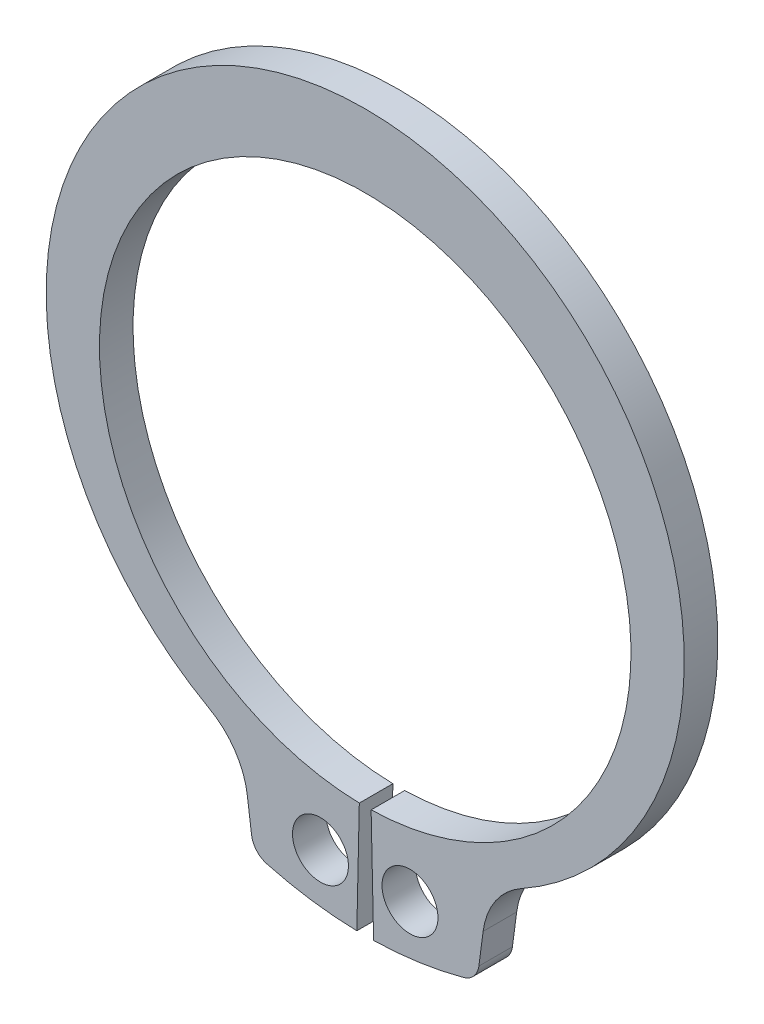
ISO-10303-21;
HEADER;
FILE_DESCRIPTION(('STEP AP214'),'2;1');
FILE_NAME('part.step','',(''),(''),'','','');
FILE_SCHEMA(('AUTOMOTIVE_DESIGN { 1 0 10303 214 1 1 1 1 }'));
ENDSEC;
DATA;
#1=APPLICATION_CONTEXT('core data for automotive mechanical design processes');
#2=APPLICATION_PROTOCOL_DEFINITION('international standard','automotive_design',2000,#1);
#3=PRODUCT_CONTEXT('',#1,'mechanical');
#4=PRODUCT('Part','Part','',(#3));
#5=PRODUCT_RELATED_PRODUCT_CATEGORY('part','',(#4));
#6=PRODUCT_DEFINITION_FORMATION('','',#4);
#7=PRODUCT_DEFINITION_CONTEXT('part definition',#1,'design');
#8=PRODUCT_DEFINITION('design','',#6,#7);
#9=PRODUCT_DEFINITION_SHAPE('','',#8);
#10=(LENGTH_UNIT() NAMED_UNIT(*) SI_UNIT(.MILLI.,.METRE.));
#11=(NAMED_UNIT(*) PLANE_ANGLE_UNIT() SI_UNIT($,.RADIAN.));
#12=(NAMED_UNIT(*) SI_UNIT($,.STERADIAN.) SOLID_ANGLE_UNIT());
#13=UNCERTAINTY_MEASURE_WITH_UNIT(LENGTH_MEASURE(1.E-05),#10,'distance_accuracy_value','');
#14=(GEOMETRIC_REPRESENTATION_CONTEXT(3) GLOBAL_UNCERTAINTY_ASSIGNED_CONTEXT((#13)) GLOBAL_UNIT_ASSIGNED_CONTEXT((#10,
#11,#12)) REPRESENTATION_CONTEXT('',''));
#15=CARTESIAN_POINT('',(0.,0.,0.));
#16=DIRECTION('',(0.,0.,1.));
#17=DIRECTION('',(1.,0.,0.));
#18=AXIS2_PLACEMENT_3D('',#15,#16,#17);
#19=CARTESIAN_POINT('',(0.,0.,-1.2));
#20=DIRECTION('',(0.,0.,1.));
#21=DIRECTION('',(1.,0.,0.));
#22=AXIS2_PLACEMENT_3D('',#19,#20,#21);
#23=CYLINDRICAL_SURFACE('',#22,9.5);
#24=CARTESIAN_POINT('',(0.,0.,0.));
#25=DIRECTION('',(0.,0.,-1.));
#26=DIRECTION('',(1.,0.,0.));
#27=AXIS2_PLACEMENT_3D('',#24,#25,#26);
#28=CIRCLE('',#27,9.5);
#29=CARTESIAN_POINT('',(-0.211111111111111,-9.49765403132613,0.));
#30=VERTEX_POINT('',#29);
#31=CARTESIAN_POINT('',(0.211111111111111,-9.49765403132613,0.));
#32=VERTEX_POINT('',#31);
#33=EDGE_CURVE('E154',#30,#32,#28,.T.);
#34=ORIENTED_EDGE('',*,*,#33,.F.);
#35=DIRECTION('',(0.,0.,1.));
#36=VECTOR('',#35,1.);
#37=CARTESIAN_POINT('',(-0.211111111111111,-9.49765403132613,-1.2));
#38=LINE('',#37,#36);
#39=CARTESIAN_POINT('',(-0.211111111111111,-9.49765403132613,-1.2));
#40=VERTEX_POINT('',#39);
#41=EDGE_CURVE('E11',#40,#30,#38,.T.);
#42=ORIENTED_EDGE('',*,*,#41,.F.);
#43=CARTESIAN_POINT('',(0.,0.,-1.2));
#44=DIRECTION('',(0.,0.,-1.));
#45=DIRECTION('',(1.,0.,0.));
#46=AXIS2_PLACEMENT_3D('',#43,#44,#45);
#47=CIRCLE('',#46,9.5);
#48=CARTESIAN_POINT('',(0.211111111111111,-9.49765403132613,-1.2));
#49=VERTEX_POINT('',#48);
#50=EDGE_CURVE('E187',#40,#49,#47,.T.);
#51=ORIENTED_EDGE('',*,*,#50,.T.);
#52=DIRECTION('',(0.,0.,1.));
#53=VECTOR('',#52,1.);
#54=CARTESIAN_POINT('',(0.211111111111111,-9.49765403132613,-1.2));
#55=LINE('',#54,#53);
#56=EDGE_CURVE('E36',#49,#32,#55,.T.);
#57=ORIENTED_EDGE('',*,*,#56,.T.);
#58=EDGE_LOOP('',(#34,#42,#51,#57));
#59=FACE_BOUND('',#58,.T.);
#60=ADVANCED_FACE('F33',(#59),#23,.F.);
#61=CARTESIAN_POINT('',(-0.211111111111111,-9.49765403132613,-1.2));
#62=DIRECTION('',(0.999753055929066,-0.0222222222222222,0.));
#63=DIRECTION('',(0.0222222222222222,0.999753055929066,0.));
#64=AXIS2_PLACEMENT_3D('',#61,#62,#63);
#65=PLANE('',#64);
#66=DIRECTION('',(0.0222222222222222,0.999753055929066,0.));
#67=VECTOR('',#66,1.);
#68=CARTESIAN_POINT('',(-0.211111111111111,-9.49765403132613,0.));
#69=LINE('',#68,#67);
#70=CARTESIAN_POINT('',(-0.3,-13.4966662550424,0.));
#71=VERTEX_POINT('',#70);
#72=EDGE_CURVE('E185',#71,#30,#69,.T.);
#73=ORIENTED_EDGE('',*,*,#72,.F.);
#74=DIRECTION('',(0.,0.,1.));
#75=VECTOR('',#74,1.);
#76=CARTESIAN_POINT('',(-0.3,-13.4966662550424,-1.2));
#77=LINE('',#76,#75);
#78=CARTESIAN_POINT('',(-0.3,-13.4966662550424,-1.2));
#79=VERTEX_POINT('',#78);
#80=EDGE_CURVE('E42',#79,#71,#77,.T.);
#81=ORIENTED_EDGE('',*,*,#80,.F.);
#82=DIRECTION('',(0.0222222222222222,0.999753055929066,0.));
#83=VECTOR('',#82,1.);
#84=CARTESIAN_POINT('',(-0.211111111111111,-9.49765403132613,-1.2));
#85=LINE('',#84,#83);
#86=EDGE_CURVE('E144',#79,#40,#85,.T.);
#87=ORIENTED_EDGE('',*,*,#86,.T.);
#88=ORIENTED_EDGE('',*,*,#41,.T.);
#89=EDGE_LOOP('',(#73,#81,#87,#88));
#90=FACE_BOUND('',#89,.T.);
#91=ADVANCED_FACE('F207',(#90),#65,.T.);
#92=CARTESIAN_POINT('',(0.,0.,-1.2));
#93=DIRECTION('',(0.,0.,1.));
#94=DIRECTION('',(1.,0.,0.));
#95=AXIS2_PLACEMENT_3D('',#92,#93,#94);
#96=CYLINDRICAL_SURFACE('',#95,13.5);
#97=CARTESIAN_POINT('',(0.,0.,0.));
#98=DIRECTION('',(0.,0.,1.));
#99=DIRECTION('',(1.,0.,0.));
#100=AXIS2_PLACEMENT_3D('',#97,#98,#99);
#101=CIRCLE('',#100,13.5);
#102=CARTESIAN_POINT('',(-3.51438519045818,-13.034534772407,0.));
#103=VERTEX_POINT('',#102);
#104=EDGE_CURVE('E131',#103,#71,#101,.T.);
#105=ORIENTED_EDGE('',*,*,#104,.F.);
#106=DIRECTION('',(0.,0.,1.));
#107=VECTOR('',#106,1.);
#108=CARTESIAN_POINT('',(-3.51438519045818,-13.034534772407,-1.2));
#109=LINE('',#108,#107);
#110=CARTESIAN_POINT('',(-3.51438519045818,-13.034534772407,-1.2));
#111=VERTEX_POINT('',#110);
#112=EDGE_CURVE('E126',#111,#103,#109,.T.);
#113=ORIENTED_EDGE('',*,*,#112,.F.);
#114=CARTESIAN_POINT('',(0.,0.,-1.2));
#115=DIRECTION('',(0.,0.,1.));
#116=DIRECTION('',(1.,0.,0.));
#117=AXIS2_PLACEMENT_3D('',#114,#115,#116);
#118=CIRCLE('',#117,13.5);
#119=EDGE_CURVE('E129',#111,#79,#118,.T.);
#120=ORIENTED_EDGE('',*,*,#119,.T.);
#121=ORIENTED_EDGE('',*,*,#80,.T.);
#122=EDGE_LOOP('',(#105,#113,#120,#121));
#123=FACE_BOUND('',#122,.T.);
#124=ADVANCED_FACE('F128',(#123),#96,.T.);
#125=CARTESIAN_POINT('',(-3.31914156876606,-12.3103939517178,-1.2));
#126=DIRECTION('',(0.,0.,1.));
#127=DIRECTION('',(1.,0.,0.));
#128=AXIS2_PLACEMENT_3D('',#125,#126,#127);
#129=CYLINDRICAL_SURFACE('',#128,0.750000000000001);
#130=CARTESIAN_POINT('',(-3.31914156876606,-12.3103939517178,0.));
#131=DIRECTION('',(0.,0.,1.));
#132=DIRECTION('',(1.,0.,0.));
#133=AXIS2_PLACEMENT_3D('',#130,#131,#132);
#134=CIRCLE('',#133,0.750000000000001);
#135=CARTESIAN_POINT('',(-4.06272521479641,-12.4082885958828,0.));
#136=VERTEX_POINT('',#135);
#137=EDGE_CURVE('E182',#136,#103,#134,.T.);
#138=ORIENTED_EDGE('',*,*,#137,.F.);
#139=DIRECTION('',(0.,0.,1.));
#140=VECTOR('',#139,1.);
#141=CARTESIAN_POINT('',(-4.06272521479641,-12.4082885958828,-1.2));
#142=LINE('',#141,#140);
#143=CARTESIAN_POINT('',(-4.06272521479641,-12.4082885958828,-1.2));
#144=VERTEX_POINT('',#143);
#145=EDGE_CURVE('E136',#144,#136,#142,.T.);
#146=ORIENTED_EDGE('',*,*,#145,.F.);
#147=CARTESIAN_POINT('',(-3.31914156876606,-12.3103939517178,-1.2));
#148=DIRECTION('',(0.,0.,1.));
#149=DIRECTION('',(1.,0.,0.));
#150=AXIS2_PLACEMENT_3D('',#147,#148,#149);
#151=CIRCLE('',#150,0.750000000000001);
#152=EDGE_CURVE('E142',#144,#111,#151,.T.);
#153=ORIENTED_EDGE('',*,*,#152,.T.);
#154=ORIENTED_EDGE('',*,*,#112,.T.);
#155=EDGE_LOOP('',(#138,#146,#153,#154));
#156=FACE_BOUND('',#155,.T.);
#157=ADVANCED_FACE('F146',(#156),#129,.T.);
#158=CARTESIAN_POINT('',(-4.21429248139649,-11.2570209072507,-1.2));
#159=DIRECTION('',(-0.99144486137381,-0.130526192220051,0.));
#160=DIRECTION('',(0.130526192220051,-0.991444861373811,0.));
#161=AXIS2_PLACEMENT_3D('',#158,#159,#160);
#162=PLANE('',#161);
#163=DIRECTION('',(0.130526192220051,-0.99144486137381,0.));
#164=VECTOR('',#163,1.);
#165=CARTESIAN_POINT('',(-4.21429248139649,-11.2570209072507,0.));
#166=LINE('',#165,#164);
#167=CARTESIAN_POINT('',(-4.21429248139649,-11.2570209072507,0.));
#168=VERTEX_POINT('',#167);
#169=EDGE_CURVE('E179',#168,#136,#166,.T.);
#170=ORIENTED_EDGE('',*,*,#169,.F.);
#171=DIRECTION('',(0.,0.,1.));
#172=VECTOR('',#171,1.);
#173=CARTESIAN_POINT('',(-4.21429248139649,-11.2570209072507,-1.2));
#174=LINE('',#173,#172);
#175=CARTESIAN_POINT('',(-4.21429248139649,-11.2570209072507,-1.2));
#176=VERTEX_POINT('',#175);
#177=EDGE_CURVE('E191',#176,#168,#174,.T.);
#178=ORIENTED_EDGE('',*,*,#177,.F.);
#179=DIRECTION('',(0.130526192220051,-0.99144486137381,0.));
#180=VECTOR('',#179,1.);
#181=CARTESIAN_POINT('',(-4.21429248139649,-11.2570209072507,-1.2));
#182=LINE('',#181,#180);
#183=EDGE_CURVE('E147',#176,#144,#182,.T.);
#184=ORIENTED_EDGE('',*,*,#183,.T.);
#185=ORIENTED_EDGE('',*,*,#145,.T.);
#186=EDGE_LOOP('',(#170,#178,#184,#185));
#187=FACE_BOUND('',#186,.T.);
#188=ADVANCED_FACE('F220',(#187),#162,.T.);
#189=CARTESIAN_POINT('',(-6.89014336040812,-11.609303358644,-1.2));
#190=DIRECTION('',(0.,0.,1.));
#191=DIRECTION('',(1.,0.,0.));
#192=AXIS2_PLACEMENT_3D('',#189,#190,#191);
#193=CYLINDRICAL_SURFACE('',#192,2.69894069076499);
#194=CARTESIAN_POINT('',(-6.89014336040812,-11.609303358644,0.));
#195=DIRECTION('',(0.,0.,-1.));
#196=DIRECTION('',(1.,0.,0.));
#197=AXIS2_PLACEMENT_3D('',#194,#195,#196);
#198=CIRCLE('',#197,2.69894069076499);
#199=CARTESIAN_POINT('',(-5.57154974289285,-9.25439535107454,0.));
#200=VERTEX_POINT('',#199);
#201=EDGE_CURVE('E176',#200,#168,#198,.T.);
#202=ORIENTED_EDGE('',*,*,#201,.F.);
#203=DIRECTION('',(0.,0.,1.));
#204=VECTOR('',#203,1.);
#205=CARTESIAN_POINT('',(-5.57154974289285,-9.25439535107454,-1.2));
#206=LINE('',#205,#204);
#207=CARTESIAN_POINT('',(-5.57154974289285,-9.25439535107454,-1.2));
#208=VERTEX_POINT('',#207);
#209=EDGE_CURVE('E193',#208,#200,#206,.T.);
#210=ORIENTED_EDGE('',*,*,#209,.F.);
#211=CARTESIAN_POINT('',(-6.89014336040812,-11.609303358644,-1.2));
#212=DIRECTION('',(0.,0.,-1.));
#213=DIRECTION('',(1.,0.,0.));
#214=AXIS2_PLACEMENT_3D('',#211,#212,#213);
#215=CIRCLE('',#214,2.69894069076499);
#216=EDGE_CURVE('E149',#208,#176,#215,.T.);
#217=ORIENTED_EDGE('',*,*,#216,.T.);
#218=ORIENTED_EDGE('',*,*,#177,.T.);
#219=EDGE_LOOP('',(#202,#210,#217,#218));
#220=FACE_BOUND('',#219,.T.);
#221=ADVANCED_FACE('F223',(#220),#193,.F.);
#222=CARTESIAN_POINT('',(0.,0.695969135623053,-1.2));
#223=DIRECTION('',(0.,0.,1.));
#224=DIRECTION('',(1.,0.,0.));
#225=AXIS2_PLACEMENT_3D('',#222,#223,#224);
#226=CYLINDRICAL_SURFACE('',#225,11.4040308643769);
#227=CARTESIAN_POINT('',(0.,0.695969135623053,0.));
#228=DIRECTION('',(0.,0.,1.));
#229=DIRECTION('',(1.,0.,0.));
#230=AXIS2_PLACEMENT_3D('',#227,#228,#229);
#231=CIRCLE('',#230,11.4040308643769);
#232=CARTESIAN_POINT('',(5.57154974289284,-9.25439535107454,0.));
#233=VERTEX_POINT('',#232);
#234=EDGE_CURVE('E173',#233,#200,#231,.T.);
#235=ORIENTED_EDGE('',*,*,#234,.F.);
#236=DIRECTION('',(0.,0.,1.));
#237=VECTOR('',#236,1.);
#238=CARTESIAN_POINT('',(5.57154974289284,-9.25439535107454,-1.2));
#239=LINE('',#238,#237);
#240=CARTESIAN_POINT('',(5.57154974289284,-9.25439535107454,-1.2));
#241=VERTEX_POINT('',#240);
#242=EDGE_CURVE('E195',#241,#233,#239,.T.);
#243=ORIENTED_EDGE('',*,*,#242,.F.);
#244=CARTESIAN_POINT('',(0.,0.695969135623053,-1.2));
#245=DIRECTION('',(0.,0.,1.));
#246=DIRECTION('',(1.,0.,0.));
#247=AXIS2_PLACEMENT_3D('',#244,#245,#246);
#248=CIRCLE('',#247,11.4040308643769);
#249=EDGE_CURVE('E297',#241,#208,#248,.T.);
#250=ORIENTED_EDGE('',*,*,#249,.T.);
#251=ORIENTED_EDGE('',*,*,#209,.T.);
#252=EDGE_LOOP('',(#235,#243,#250,#251));
#253=FACE_BOUND('',#252,.T.);
#254=ADVANCED_FACE('F227',(#253),#226,.T.);
#255=CARTESIAN_POINT('',(6.89014336040812,-11.609303358644,-1.2));
#256=DIRECTION('',(0.,0.,1.));
#257=DIRECTION('',(1.,0.,0.));
#258=AXIS2_PLACEMENT_3D('',#255,#256,#257);
#259=CYLINDRICAL_SURFACE('',#258,2.69894069076499);
#260=CARTESIAN_POINT('',(6.89014336040812,-11.609303358644,0.));
#261=DIRECTION('',(0.,0.,-1.));
#262=DIRECTION('',(1.,0.,0.));
#263=AXIS2_PLACEMENT_3D('',#260,#261,#262);
#264=CIRCLE('',#263,2.69894069076499);
#265=CARTESIAN_POINT('',(4.21429248139649,-11.2570209072507,0.));
#266=VERTEX_POINT('',#265);
#267=EDGE_CURVE('E170',#266,#233,#264,.T.);
#268=ORIENTED_EDGE('',*,*,#267,.F.);
#269=DIRECTION('',(0.,0.,1.));
#270=VECTOR('',#269,1.);
#271=CARTESIAN_POINT('',(4.21429248139649,-11.2570209072507,-1.2));
#272=LINE('',#271,#270);
#273=CARTESIAN_POINT('',(4.21429248139649,-11.2570209072507,-1.2));
#274=VERTEX_POINT('',#273);
#275=EDGE_CURVE('E197',#274,#266,#272,.T.);
#276=ORIENTED_EDGE('',*,*,#275,.F.);
#277=CARTESIAN_POINT('',(6.89014336040812,-11.609303358644,-1.2));
#278=DIRECTION('',(0.,0.,-1.));
#279=DIRECTION('',(1.,0.,0.));
#280=AXIS2_PLACEMENT_3D('',#277,#278,#279);
#281=CIRCLE('',#280,2.69894069076499);
#282=EDGE_CURVE('E294',#274,#241,#281,.T.);
#283=ORIENTED_EDGE('',*,*,#282,.T.);
#284=ORIENTED_EDGE('',*,*,#242,.T.);
#285=EDGE_LOOP('',(#268,#276,#283,#284));
#286=FACE_BOUND('',#285,.T.);
#287=ADVANCED_FACE('F231',(#286),#259,.F.);
#288=CARTESIAN_POINT('',(4.21429248139649,-11.2570209072507,-1.2));
#289=DIRECTION('',(0.99144486137381,-0.130526192220051,0.));
#290=DIRECTION('',(0.130526192220051,0.991444861373811,0.));
#291=AXIS2_PLACEMENT_3D('',#288,#289,#290);
#292=PLANE('',#291);
#293=DIRECTION('',(0.130526192220051,0.99144486137381,0.));
#294=VECTOR('',#293,1.);
#295=CARTESIAN_POINT('',(4.21429248139649,-11.2570209072507,0.));
#296=LINE('',#295,#294);
#297=CARTESIAN_POINT('',(4.06272521479641,-12.4082885958828,0.));
#298=VERTEX_POINT('',#297);
#299=EDGE_CURVE('E167',#298,#266,#296,.T.);
#300=ORIENTED_EDGE('',*,*,#299,.F.);
#301=DIRECTION('',(0.,0.,1.));
#302=VECTOR('',#301,1.);
#303=CARTESIAN_POINT('',(4.06272521479641,-12.4082885958828,-1.2));
#304=LINE('',#303,#302);
#305=CARTESIAN_POINT('',(4.06272521479641,-12.4082885958828,-1.2));
#306=VERTEX_POINT('',#305);
#307=EDGE_CURVE('E199',#306,#298,#304,.T.);
#308=ORIENTED_EDGE('',*,*,#307,.F.);
#309=DIRECTION('',(0.130526192220051,0.99144486137381,0.));
#310=VECTOR('',#309,1.);
#311=CARTESIAN_POINT('',(4.21429248139649,-11.2570209072507,-1.2));
#312=LINE('',#311,#310);
#313=EDGE_CURVE('E291',#306,#274,#312,.T.);
#314=ORIENTED_EDGE('',*,*,#313,.T.);
#315=ORIENTED_EDGE('',*,*,#275,.T.);
#316=EDGE_LOOP('',(#300,#308,#314,#315));
#317=FACE_BOUND('',#316,.T.);
#318=ADVANCED_FACE('F235',(#317),#292,.T.);
#319=CARTESIAN_POINT('',(3.31914156876606,-12.3103939517178,-1.2));
#320=DIRECTION('',(0.,0.,1.));
#321=DIRECTION('',(1.,0.,0.));
#322=AXIS2_PLACEMENT_3D('',#319,#320,#321);
#323=CYLINDRICAL_SURFACE('',#322,0.750000000000001);
#324=CARTESIAN_POINT('',(3.31914156876606,-12.3103939517178,0.));
#325=DIRECTION('',(0.,0.,1.));
#326=DIRECTION('',(-1.,0.,0.));
#327=AXIS2_PLACEMENT_3D('',#324,#325,#326);
#328=CIRCLE('',#327,0.750000000000001);
#329=CARTESIAN_POINT('',(3.51438519045818,-13.034534772407,0.));
#330=VERTEX_POINT('',#329);
#331=EDGE_CURVE('E164',#330,#298,#328,.T.);
#332=ORIENTED_EDGE('',*,*,#331,.F.);
#333=DIRECTION('',(0.,0.,1.));
#334=VECTOR('',#333,1.);
#335=CARTESIAN_POINT('',(3.51438519045818,-13.034534772407,-1.2));
#336=LINE('',#335,#334);
#337=CARTESIAN_POINT('',(3.51438519045818,-13.034534772407,-1.2));
#338=VERTEX_POINT('',#337);
#339=EDGE_CURVE('E201',#338,#330,#336,.T.);
#340=ORIENTED_EDGE('',*,*,#339,.F.);
#341=CARTESIAN_POINT('',(3.31914156876606,-12.3103939517178,-1.2));
#342=DIRECTION('',(0.,0.,1.));
#343=DIRECTION('',(-1.,0.,0.));
#344=AXIS2_PLACEMENT_3D('',#341,#342,#343);
#345=CIRCLE('',#344,0.750000000000001);
#346=EDGE_CURVE('E288',#338,#306,#345,.T.);
#347=ORIENTED_EDGE('',*,*,#346,.T.);
#348=ORIENTED_EDGE('',*,*,#307,.T.);
#349=EDGE_LOOP('',(#332,#340,#347,#348));
#350=FACE_BOUND('',#349,.T.);
#351=ADVANCED_FACE('F239',(#350),#323,.T.);
#352=CARTESIAN_POINT('',(0.,0.,-1.2));
#353=DIRECTION('',(0.,0.,1.));
#354=DIRECTION('',(1.,0.,0.));
#355=AXIS2_PLACEMENT_3D('',#352,#353,#354);
#356=CYLINDRICAL_SURFACE('',#355,13.5);
#357=CARTESIAN_POINT('',(0.,0.,0.));
#358=DIRECTION('',(0.,0.,1.));
#359=DIRECTION('',(1.,0.,0.));
#360=AXIS2_PLACEMENT_3D('',#357,#358,#359);
#361=CIRCLE('',#360,13.5);
#362=CARTESIAN_POINT('',(0.29999999999999,-13.4966662550424,0.));
#363=VERTEX_POINT('',#362);
#364=EDGE_CURVE('E161',#363,#330,#361,.T.);
#365=ORIENTED_EDGE('',*,*,#364,.F.);
#366=DIRECTION('',(0.,0.,1.));
#367=VECTOR('',#366,1.);
#368=CARTESIAN_POINT('',(0.29999999999999,-13.4966662550424,-1.2));
#369=LINE('',#368,#367);
#370=CARTESIAN_POINT('',(0.29999999999999,-13.4966662550424,-1.2));
#371=VERTEX_POINT('',#370);
#372=EDGE_CURVE('E202',#371,#363,#369,.T.);
#373=ORIENTED_EDGE('',*,*,#372,.F.);
#374=CARTESIAN_POINT('',(0.,0.,-1.2));
#375=DIRECTION('',(0.,0.,1.));
#376=DIRECTION('',(1.,0.,0.));
#377=AXIS2_PLACEMENT_3D('',#374,#375,#376);
#378=CIRCLE('',#377,13.5);
#379=EDGE_CURVE('E285',#371,#338,#378,.T.);
#380=ORIENTED_EDGE('',*,*,#379,.T.);
#381=ORIENTED_EDGE('',*,*,#339,.T.);
#382=EDGE_LOOP('',(#365,#373,#380,#381));
#383=FACE_BOUND('',#382,.T.);
#384=ADVANCED_FACE('F243',(#383),#356,.T.);
#385=CARTESIAN_POINT('',(0.211111111111111,-9.49765403132613,-1.2));
#386=DIRECTION('',(-0.999753055929066,-0.0222222222222222,0.));
#387=DIRECTION('',(0.0222222222222222,-0.999753055929066,0.));
#388=AXIS2_PLACEMENT_3D('',#385,#386,#387);
#389=PLANE('',#388);
#390=DIRECTION('',(0.0222222222222222,-0.999753055929066,0.));
#391=VECTOR('',#390,1.);
#392=CARTESIAN_POINT('',(0.211111111111111,-9.49765403132613,0.));
#393=LINE('',#392,#391);
#394=EDGE_CURVE('E157',#32,#363,#393,.T.);
#395=ORIENTED_EDGE('',*,*,#394,.F.);
#396=ORIENTED_EDGE('',*,*,#56,.F.);
#397=DIRECTION('',(0.0222222222222222,-0.999753055929066,0.));
#398=VECTOR('',#397,1.);
#399=CARTESIAN_POINT('',(0.211111111111111,-9.49765403132613,-1.2));
#400=LINE('',#399,#398);
#401=EDGE_CURVE('E283',#49,#371,#400,.T.);
#402=ORIENTED_EDGE('',*,*,#401,.T.);
#403=ORIENTED_EDGE('',*,*,#372,.T.);
#404=EDGE_LOOP('',(#395,#396,#402,#403));
#405=FACE_BOUND('',#404,.T.);
#406=ADVANCED_FACE('F204',(#405),#389,.T.);
#407=CARTESIAN_POINT('',(0.,0.,-1.2));
#408=DIRECTION('',(0.,0.,1.));
#409=DIRECTION('',(1.,0.,0.));
#410=AXIS2_PLACEMENT_3D('',#407,#408,#409);
#411=PLANE('',#410);
#412=CARTESIAN_POINT('',(-1.6,-11.6405541105224,-1.2));
#413=DIRECTION('',(0.,0.,1.));
#414=DIRECTION('',(1.,0.,0.));
#415=AXIS2_PLACEMENT_3D('',#412,#413,#414);
#416=CIRCLE('',#415,1.);
#417=CARTESIAN_POINT('',(-0.6,-11.6405541105224,-1.2));
#418=VERTEX_POINT('',#417);
#419=EDGE_CURVE('E270',#418,#418,#416,.T.);
#420=ORIENTED_EDGE('',*,*,#419,.T.);
#421=EDGE_LOOP('',(#420));
#422=FACE_BOUND('',#421,.T.);
#423=CARTESIAN_POINT('',(1.6,-11.6405541105224,-1.2));
#424=DIRECTION('',(0.,0.,1.));
#425=DIRECTION('',(1.,0.,0.));
#426=AXIS2_PLACEMENT_3D('',#423,#424,#425);
#427=CIRCLE('',#426,1.);
#428=CARTESIAN_POINT('',(2.6,-11.6405541105224,-1.2));
#429=VERTEX_POINT('',#428);
#430=EDGE_CURVE('E158',#429,#429,#427,.T.);
#431=ORIENTED_EDGE('',*,*,#430,.T.);
#432=EDGE_LOOP('',(#431));
#433=FACE_BOUND('',#432,.T.);
#434=ORIENTED_EDGE('',*,*,#50,.F.);
#435=ORIENTED_EDGE('',*,*,#86,.F.);
#436=ORIENTED_EDGE('',*,*,#119,.F.);
#437=ORIENTED_EDGE('',*,*,#152,.F.);
#438=ORIENTED_EDGE('',*,*,#183,.F.);
#439=ORIENTED_EDGE('',*,*,#216,.F.);
#440=ORIENTED_EDGE('',*,*,#249,.F.);
#441=ORIENTED_EDGE('',*,*,#282,.F.);
#442=ORIENTED_EDGE('',*,*,#313,.F.);
#443=ORIENTED_EDGE('',*,*,#346,.F.);
#444=ORIENTED_EDGE('',*,*,#379,.F.);
#445=ORIENTED_EDGE('',*,*,#401,.F.);
#446=EDGE_LOOP('',(#434,#435,#436,#437,#438,#439,#440,#441,#442,#443,#444,#445));
#447=FACE_BOUND('',#446,.T.);
#448=ADVANCED_FACE('F140',(#422,#433,#447),#411,.F.);
#449=CARTESIAN_POINT('',(0.,0.,0.));
#450=DIRECTION('',(0.,0.,1.));
#451=DIRECTION('',(1.,0.,0.));
#452=AXIS2_PLACEMENT_3D('',#449,#450,#451);
#453=PLANE('',#452);
#454=CARTESIAN_POINT('',(-1.6,-11.6405541105224,0.));
#455=DIRECTION('',(0.,0.,1.));
#456=DIRECTION('',(1.,0.,0.));
#457=AXIS2_PLACEMENT_3D('',#454,#455,#456);
#458=CIRCLE('',#457,1.);
#459=CARTESIAN_POINT('',(-0.6,-11.6405541105224,0.));
#460=VERTEX_POINT('',#459);
#461=EDGE_CURVE('E273',#460,#460,#458,.T.);
#462=ORIENTED_EDGE('',*,*,#461,.F.);
#463=EDGE_LOOP('',(#462));
#464=FACE_BOUND('',#463,.T.);
#465=CARTESIAN_POINT('',(1.6,-11.6405541105224,0.));
#466=DIRECTION('',(0.,0.,1.));
#467=DIRECTION('',(1.,0.,0.));
#468=AXIS2_PLACEMENT_3D('',#465,#466,#467);
#469=CIRCLE('',#468,1.);
#470=CARTESIAN_POINT('',(2.6,-11.6405541105224,0.));
#471=VERTEX_POINT('',#470);
#472=EDGE_CURVE('E275',#471,#471,#469,.T.);
#473=ORIENTED_EDGE('',*,*,#472,.F.);
#474=EDGE_LOOP('',(#473));
#475=FACE_BOUND('',#474,.T.);
#476=ORIENTED_EDGE('',*,*,#33,.T.);
#477=ORIENTED_EDGE('',*,*,#394,.T.);
#478=ORIENTED_EDGE('',*,*,#364,.T.);
#479=ORIENTED_EDGE('',*,*,#331,.T.);
#480=ORIENTED_EDGE('',*,*,#299,.T.);
#481=ORIENTED_EDGE('',*,*,#267,.T.);
#482=ORIENTED_EDGE('',*,*,#234,.T.);
#483=ORIENTED_EDGE('',*,*,#201,.T.);
#484=ORIENTED_EDGE('',*,*,#169,.T.);
#485=ORIENTED_EDGE('',*,*,#137,.T.);
#486=ORIENTED_EDGE('',*,*,#104,.T.);
#487=ORIENTED_EDGE('',*,*,#72,.T.);
#488=EDGE_LOOP('',(#476,#477,#478,#479,#480,#481,#482,#483,#484,#485,#486,#487));
#489=FACE_BOUND('',#488,.T.);
#490=ADVANCED_FACE('F206',(#464,#475,#489),#453,.T.);
#491=CARTESIAN_POINT('',(1.6,-11.6405541105224,-1.2));
#492=DIRECTION('',(0.,0.,1.));
#493=DIRECTION('',(1.,0.,0.));
#494=AXIS2_PLACEMENT_3D('',#491,#492,#493);
#495=CYLINDRICAL_SURFACE('',#494,1.);
#496=ORIENTED_EDGE('',*,*,#430,.F.);
#497=EDGE_LOOP('',(#496));
#498=FACE_BOUND('',#497,.T.);
#499=ORIENTED_EDGE('',*,*,#472,.T.);
#500=EDGE_LOOP('',(#499));
#501=FACE_BOUND('',#500,.T.);
#502=ADVANCED_FACE('F255',(#498,#501),#495,.F.);
#503=CARTESIAN_POINT('',(-1.6,-11.6405541105224,-1.2));
#504=DIRECTION('',(0.,0.,1.));
#505=DIRECTION('',(1.,0.,0.));
#506=AXIS2_PLACEMENT_3D('',#503,#504,#505);
#507=CYLINDRICAL_SURFACE('',#506,1.);
#508=ORIENTED_EDGE('',*,*,#419,.F.);
#509=EDGE_LOOP('',(#508));
#510=FACE_BOUND('',#509,.T.);
#511=ORIENTED_EDGE('',*,*,#461,.T.);
#512=EDGE_LOOP('',(#511));
#513=FACE_BOUND('',#512,.T.);
#514=ADVANCED_FACE('F262',(#510,#513),#507,.F.);
#515=CLOSED_SHELL('',(#60,#91,#124,#157,#188,#221,#254,#287,#318,#351,#384,#406,#448,#490,#502,#514));
#516=MANIFOLD_SOLID_BREP('B2',#515);
#517=ADVANCED_BREP_SHAPE_REPRESENTATION('',(#18,#516),#14);
#518=SHAPE_DEFINITION_REPRESENTATION(#9,#517);
ENDSEC;
END-ISO-10303-21;
